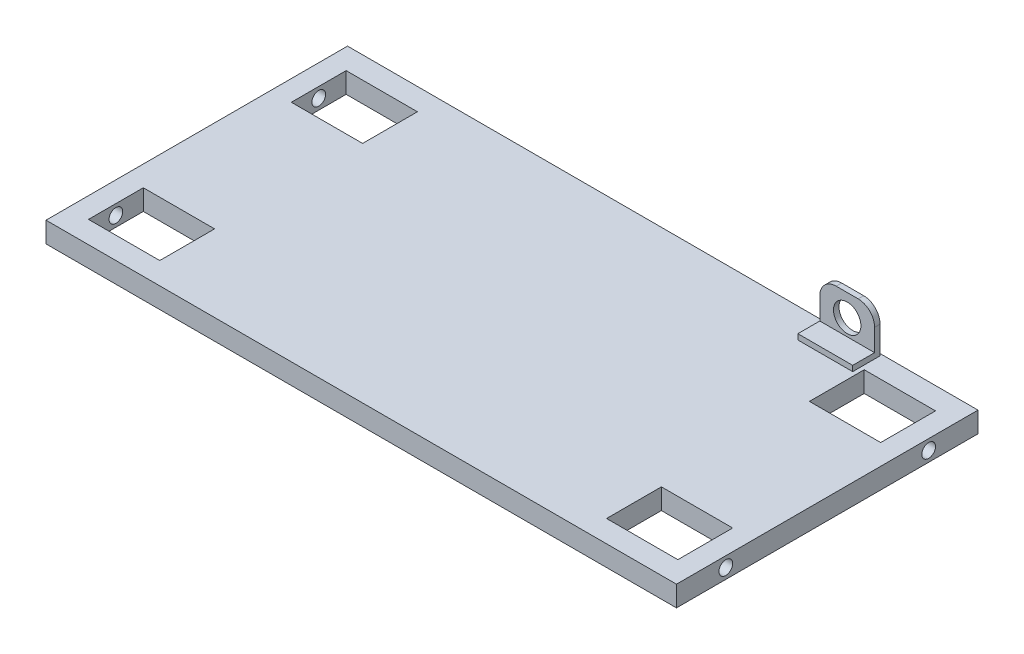
ISO-10303-21;
HEADER;
FILE_DESCRIPTION(('STEP AP214'),'2;1');
FILE_NAME('part.step','',(''),(''),'','','');
FILE_SCHEMA(('AUTOMOTIVE_DESIGN { 1 0 10303 214 1 1 1 1 }'));
ENDSEC;
DATA;
#1=APPLICATION_CONTEXT('core data for automotive mechanical design processes');
#2=APPLICATION_PROTOCOL_DEFINITION('international standard','automotive_design',2000,#1);
#3=PRODUCT_CONTEXT('',#1,'mechanical');
#4=PRODUCT('Part','Part','',(#3));
#5=PRODUCT_RELATED_PRODUCT_CATEGORY('part','',(#4));
#6=PRODUCT_DEFINITION_FORMATION('','',#4);
#7=PRODUCT_DEFINITION_CONTEXT('part definition',#1,'design');
#8=PRODUCT_DEFINITION('design','',#6,#7);
#9=PRODUCT_DEFINITION_SHAPE('','',#8);
#10=(LENGTH_UNIT() NAMED_UNIT(*) SI_UNIT(.MILLI.,.METRE.));
#11=(NAMED_UNIT(*) PLANE_ANGLE_UNIT() SI_UNIT($,.RADIAN.));
#12=(NAMED_UNIT(*) SI_UNIT($,.STERADIAN.) SOLID_ANGLE_UNIT());
#13=UNCERTAINTY_MEASURE_WITH_UNIT(LENGTH_MEASURE(1.E-05),#10,'distance_accuracy_value','');
#14=(GEOMETRIC_REPRESENTATION_CONTEXT(3) GLOBAL_UNCERTAINTY_ASSIGNED_CONTEXT((#13)) GLOBAL_UNIT_ASSIGNED_CONTEXT((#10,
#11,#12)) REPRESENTATION_CONTEXT('',''));
#15=CARTESIAN_POINT('',(0.,0.,0.));
#16=DIRECTION('',(0.,0.,1.));
#17=DIRECTION('',(1.,0.,0.));
#18=AXIS2_PLACEMENT_3D('',#15,#16,#17);
#19=CARTESIAN_POINT('',(76.1999999999999,29.845,-56.2407372591082));
#20=DIRECTION('',(0.,0.,-1.));
#21=DIRECTION('',(-1.,0.,0.));
#22=AXIS2_PLACEMENT_3D('',#19,#20,#21);
#23=PLANE('',#22);
#24=DIRECTION('',(1.,0.,0.));
#25=VECTOR('',#24,1.);
#26=CARTESIAN_POINT('',(76.1999999999999,12.065,-56.2407372591082));
#27=LINE('',#26,#25);
#28=CARTESIAN_POINT('',(76.1999999999999,12.065,-56.2407372591082));
#29=VERTEX_POINT('',#28);
#30=CARTESIAN_POINT('',(101.6,12.065,-56.2407372591082));
#31=VERTEX_POINT('',#30);
#32=EDGE_CURVE('E224',#29,#31,#27,.T.);
#33=ORIENTED_EDGE('',*,*,#32,.F.);
#34=DIRECTION('',(0.,-1.,0.));
#35=VECTOR('',#34,1.);
#36=CARTESIAN_POINT('',(76.1999999999999,29.845,-56.2407372591082));
#37=LINE('',#36,#35);
#38=CARTESIAN_POINT('',(76.1999999999999,9.525,-56.2407372591082));
#39=VERTEX_POINT('',#38);
#40=EDGE_CURVE('E234',#29,#39,#37,.T.);
#41=ORIENTED_EDGE('',*,*,#40,.T.);
#42=DIRECTION('',(1.,0.,0.));
#43=VECTOR('',#42,1.);
#44=CARTESIAN_POINT('',(76.1999999999999,9.525,-56.2407372591082));
#45=LINE('',#44,#43);
#46=CARTESIAN_POINT('',(101.6,9.525,-56.2407372591082));
#47=VERTEX_POINT('',#46);
#48=EDGE_CURVE('E450',#39,#47,#45,.T.);
#49=ORIENTED_EDGE('',*,*,#48,.T.);
#50=DIRECTION('',(0.,-1.,0.));
#51=VECTOR('',#50,1.);
#52=CARTESIAN_POINT('',(101.6,29.845,-56.2407372591082));
#53=LINE('',#52,#51);
#54=EDGE_CURVE('E236',#31,#47,#53,.T.);
#55=ORIENTED_EDGE('',*,*,#54,.F.);
#56=EDGE_LOOP('',(#33,#41,#49,#55));
#57=FACE_BOUND('',#56,.T.);
#58=ADVANCED_FACE('F36',(#57),#23,.F.);
#59=CARTESIAN_POINT('',(0.,9.525,0.));
#60=DIRECTION('',(0.,1.,0.));
#61=DIRECTION('',(0.,0.,1.));
#62=AXIS2_PLACEMENT_3D('',#59,#60,#61);
#63=PLANE('',#62);
#64=DIRECTION('',(0.,0.,-1.));
#65=VECTOR('',#64,1.);
#66=CARTESIAN_POINT('',(-103.505,9.525,59.69));
#67=LINE('',#66,#65);
#68=CARTESIAN_POINT('',(-103.505,9.525,59.69));
#69=VERTEX_POINT('',#68);
#70=CARTESIAN_POINT('',(-103.505,9.525,34.29));
#71=VERTEX_POINT('',#70);
#72=EDGE_CURVE('E282',#69,#71,#67,.T.);
#73=ORIENTED_EDGE('',*,*,#72,.F.);
#74=DIRECTION('',(1.,0.,0.));
#75=VECTOR('',#74,1.);
#76=CARTESIAN_POINT('',(-103.505,9.525,59.69));
#77=LINE('',#76,#75);
#78=CARTESIAN_POINT('',(-136.525,9.525,59.69));
#79=VERTEX_POINT('',#78);
#80=EDGE_CURVE('E291',#79,#69,#77,.T.);
#81=ORIENTED_EDGE('',*,*,#80,.F.);
#82=DIRECTION('',(0.,0.,1.));
#83=VECTOR('',#82,1.);
#84=CARTESIAN_POINT('',(-136.525,9.525,59.69));
#85=LINE('',#84,#83);
#86=CARTESIAN_POINT('',(-136.525,9.525,34.29));
#87=VERTEX_POINT('',#86);
#88=EDGE_CURVE('E288',#87,#79,#85,.T.);
#89=ORIENTED_EDGE('',*,*,#88,.F.);
#90=DIRECTION('',(-1.,0.,0.));
#91=VECTOR('',#90,1.);
#92=CARTESIAN_POINT('',(-136.525,9.525,34.29));
#93=LINE('',#92,#91);
#94=EDGE_CURVE('E284',#71,#87,#93,.T.);
#95=ORIENTED_EDGE('',*,*,#94,.F.);
#96=EDGE_LOOP('',(#73,#81,#89,#95));
#97=FACE_BOUND('',#96,.T.);
#98=DIRECTION('',(1.,0.,0.));
#99=VECTOR('',#98,1.);
#100=CARTESIAN_POINT('',(136.525,9.525,-34.29));
#101=LINE('',#100,#99);
#102=CARTESIAN_POINT('',(103.505,9.525,-34.29));
#103=VERTEX_POINT('',#102);
#104=CARTESIAN_POINT('',(136.525,9.525,-34.29));
#105=VERTEX_POINT('',#104);
#106=EDGE_CURVE('E312',#103,#105,#101,.T.);
#107=ORIENTED_EDGE('',*,*,#106,.F.);
#108=DIRECTION('',(0.,0.,1.));
#109=VECTOR('',#108,1.);
#110=CARTESIAN_POINT('',(103.505,9.525,-34.29));
#111=LINE('',#110,#109);
#112=CARTESIAN_POINT('',(103.505,9.525,-59.69));
#113=VERTEX_POINT('',#112);
#114=EDGE_CURVE('E321',#113,#103,#111,.T.);
#115=ORIENTED_EDGE('',*,*,#114,.F.);
#116=DIRECTION('',(-1.,0.,0.));
#117=VECTOR('',#116,1.);
#118=CARTESIAN_POINT('',(103.505,9.525,-59.69));
#119=LINE('',#118,#117);
#120=CARTESIAN_POINT('',(136.525,9.525,-59.69));
#121=VERTEX_POINT('',#120);
#122=EDGE_CURVE('E318',#121,#113,#119,.T.);
#123=ORIENTED_EDGE('',*,*,#122,.F.);
#124=DIRECTION('',(0.,0.,-1.));
#125=VECTOR('',#124,1.);
#126=CARTESIAN_POINT('',(136.525,9.525,-34.29));
#127=LINE('',#126,#125);
#128=EDGE_CURVE('E314',#105,#121,#127,.T.);
#129=ORIENTED_EDGE('',*,*,#128,.F.);
#130=EDGE_LOOP('',(#107,#115,#123,#129));
#131=FACE_BOUND('',#130,.T.);
#132=DIRECTION('',(0.,0.,1.));
#133=VECTOR('',#132,1.);
#134=CARTESIAN_POINT('',(103.505,9.525,59.69));
#135=LINE('',#134,#133);
#136=CARTESIAN_POINT('',(103.505,9.525,34.29));
#137=VERTEX_POINT('',#136);
#138=CARTESIAN_POINT('',(103.505,9.525,59.69));
#139=VERTEX_POINT('',#138);
#140=EDGE_CURVE('E270',#137,#139,#135,.T.);
#141=ORIENTED_EDGE('',*,*,#140,.F.);
#142=DIRECTION('',(-1.,0.,0.));
#143=VECTOR('',#142,1.);
#144=CARTESIAN_POINT('',(136.525,9.525,34.29));
#145=LINE('',#144,#143);
#146=CARTESIAN_POINT('',(136.525,9.525,34.29));
#147=VERTEX_POINT('',#146);
#148=EDGE_CURVE('E348',#147,#137,#145,.T.);
#149=ORIENTED_EDGE('',*,*,#148,.F.);
#150=DIRECTION('',(0.,0.,-1.));
#151=VECTOR('',#150,1.);
#152=CARTESIAN_POINT('',(136.525,9.525,59.69));
#153=LINE('',#152,#151);
#154=CARTESIAN_POINT('',(136.525,9.525,59.69));
#155=VERTEX_POINT('',#154);
#156=EDGE_CURVE('E345',#155,#147,#153,.T.);
#157=ORIENTED_EDGE('',*,*,#156,.F.);
#158=DIRECTION('',(1.,0.,0.));
#159=VECTOR('',#158,1.);
#160=CARTESIAN_POINT('',(103.505,9.525,59.69));
#161=LINE('',#160,#159);
#162=EDGE_CURVE('E342',#139,#155,#161,.T.);
#163=ORIENTED_EDGE('',*,*,#162,.F.);
#164=EDGE_LOOP('',(#141,#149,#157,#163));
#165=FACE_BOUND('',#164,.T.);
#166=DIRECTION('',(0.,0.,1.));
#167=VECTOR('',#166,1.);
#168=CARTESIAN_POINT('',(-136.525,9.525,-34.29));
#169=LINE('',#168,#167);
#170=CARTESIAN_POINT('',(-136.525,9.525,-59.69));
#171=VERTEX_POINT('',#170);
#172=CARTESIAN_POINT('',(-136.525,9.525,-34.29));
#173=VERTEX_POINT('',#172);
#174=EDGE_CURVE('E303',#171,#173,#169,.T.);
#175=ORIENTED_EDGE('',*,*,#174,.F.);
#176=DIRECTION('',(-1.,0.,0.));
#177=VECTOR('',#176,1.);
#178=CARTESIAN_POINT('',(-103.505,9.525,-59.69));
#179=LINE('',#178,#177);
#180=CARTESIAN_POINT('',(-103.505,9.525,-59.69));
#181=VERTEX_POINT('',#180);
#182=EDGE_CURVE('E376',#181,#171,#179,.T.);
#183=ORIENTED_EDGE('',*,*,#182,.F.);
#184=DIRECTION('',(0.,0.,-1.));
#185=VECTOR('',#184,1.);
#186=CARTESIAN_POINT('',(-103.505,9.525,-34.29));
#187=LINE('',#186,#185);
#188=CARTESIAN_POINT('',(-103.505,9.525,-34.29));
#189=VERTEX_POINT('',#188);
#190=EDGE_CURVE('E373',#189,#181,#187,.T.);
#191=ORIENTED_EDGE('',*,*,#190,.F.);
#192=DIRECTION('',(1.,0.,0.));
#193=VECTOR('',#192,1.);
#194=CARTESIAN_POINT('',(-136.525,9.525,-34.29));
#195=LINE('',#194,#193);
#196=EDGE_CURVE('E370',#173,#189,#195,.T.);
#197=ORIENTED_EDGE('',*,*,#196,.F.);
#198=EDGE_LOOP('',(#175,#183,#191,#197));
#199=FACE_BOUND('',#198,.T.);
#200=DIRECTION('',(0.,0.,1.));
#201=VECTOR('',#200,1.);
#202=CARTESIAN_POINT('',(-146.05,9.525,69.85));
#203=LINE('',#202,#201);
#204=CARTESIAN_POINT('',(-146.05,9.525,-69.85));
#205=VERTEX_POINT('',#204);
#206=CARTESIAN_POINT('',(-146.05,9.525,69.85));
#207=VERTEX_POINT('',#206);
#208=EDGE_CURVE('E389',#205,#207,#203,.T.);
#209=ORIENTED_EDGE('',*,*,#208,.T.);
#210=DIRECTION('',(1.,0.,0.));
#211=VECTOR('',#210,1.);
#212=CARTESIAN_POINT('',(146.05,9.525,69.85));
#213=LINE('',#212,#211);
#214=CARTESIAN_POINT('',(146.05,9.525,69.85));
#215=VERTEX_POINT('',#214);
#216=EDGE_CURVE('E392',#207,#215,#213,.T.);
#217=ORIENTED_EDGE('',*,*,#216,.T.);
#218=DIRECTION('',(0.,0.,-1.));
#219=VECTOR('',#218,1.);
#220=CARTESIAN_POINT('',(146.05,9.525,69.85));
#221=LINE('',#220,#219);
#222=CARTESIAN_POINT('',(146.05,9.525,-69.85));
#223=VERTEX_POINT('',#222);
#224=EDGE_CURVE('E395',#215,#223,#221,.T.);
#225=ORIENTED_EDGE('',*,*,#224,.T.);
#226=DIRECTION('',(-1.,0.,0.));
#227=VECTOR('',#226,1.);
#228=CARTESIAN_POINT('',(146.05,9.525,-69.85));
#229=LINE('',#228,#227);
#230=EDGE_CURVE('E397',#223,#205,#229,.T.);
#231=ORIENTED_EDGE('',*,*,#230,.T.);
#232=EDGE_LOOP('',(#209,#217,#225,#231));
#233=FACE_BOUND('',#232,.T.);
#234=ORIENTED_EDGE('',*,*,#48,.F.);
#235=DIRECTION('',(0.,0.,1.));
#236=VECTOR('',#235,1.);
#237=CARTESIAN_POINT('',(76.1999999999999,9.525,-68.9407372591082));
#238=LINE('',#237,#236);
#239=CARTESIAN_POINT('',(76.1999999999999,9.525,-68.9407372591082));
#240=VERTEX_POINT('',#239);
#241=EDGE_CURVE('E241',#240,#39,#238,.T.);
#242=ORIENTED_EDGE('',*,*,#241,.F.);
#243=DIRECTION('',(-1.,0.,0.));
#244=VECTOR('',#243,1.);
#245=CARTESIAN_POINT('',(76.1999999999999,9.525,-68.9407372591082));
#246=LINE('',#245,#244);
#247=CARTESIAN_POINT('',(101.6,9.525,-68.9407372591082));
#248=VERTEX_POINT('',#247);
#249=EDGE_CURVE('E442',#248,#240,#246,.T.);
#250=ORIENTED_EDGE('',*,*,#249,.F.);
#251=DIRECTION('',(0.,0.,-1.));
#252=VECTOR('',#251,1.);
#253=CARTESIAN_POINT('',(101.6,9.525,-68.9407372591082));
#254=LINE('',#253,#252);
#255=EDGE_CURVE('E458',#47,#248,#254,.T.);
#256=ORIENTED_EDGE('',*,*,#255,.F.);
#257=EDGE_LOOP('',(#234,#242,#250,#256));
#258=FACE_BOUND('',#257,.T.);
#259=ADVANCED_FACE('F468',(#97,#131,#165,#199,#233,#258),#63,.T.);
#260=CARTESIAN_POINT('',(-146.05,9.525,69.85));
#261=DIRECTION('',(1.,0.,0.));
#262=DIRECTION('',(0.,0.,-1.));
#263=AXIS2_PLACEMENT_3D('',#260,#261,#262);
#264=PLANE('',#263);
#265=CARTESIAN_POINT('',(-146.05,4.76249999999973,-46.99));
#266=DIRECTION('',(1.,0.,0.));
#267=DIRECTION('',(0.,0.,1.));
#268=AXIS2_PLACEMENT_3D('',#265,#266,#267);
#269=CIRCLE('',#268,3.175);
#270=CARTESIAN_POINT('',(-146.05,4.76249999999973,-43.815));
#271=VERTEX_POINT('',#270);
#272=EDGE_CURVE('E243',#271,#271,#269,.T.);
#273=ORIENTED_EDGE('',*,*,#272,.T.);
#274=EDGE_LOOP('',(#273));
#275=FACE_BOUND('',#274,.T.);
#276=CARTESIAN_POINT('',(-146.05,4.7625,46.99));
#277=DIRECTION('',(1.,0.,0.));
#278=DIRECTION('',(0.,0.,-1.));
#279=AXIS2_PLACEMENT_3D('',#276,#277,#278);
#280=CIRCLE('',#279,3.175);
#281=CARTESIAN_POINT('',(-146.05,4.7625,43.815));
#282=VERTEX_POINT('',#281);
#283=EDGE_CURVE('E253',#282,#282,#280,.T.);
#284=ORIENTED_EDGE('',*,*,#283,.T.);
#285=EDGE_LOOP('',(#284));
#286=FACE_BOUND('',#285,.T.);
#287=DIRECTION('',(0.,0.,1.));
#288=VECTOR('',#287,1.);
#289=CARTESIAN_POINT('',(-146.05,0.,69.85));
#290=LINE('',#289,#288);
#291=CARTESIAN_POINT('',(-146.05,0.,-69.85));
#292=VERTEX_POINT('',#291);
#293=CARTESIAN_POINT('',(-146.05,0.,69.85));
#294=VERTEX_POINT('',#293);
#295=EDGE_CURVE('E388',#292,#294,#290,.T.);
#296=ORIENTED_EDGE('',*,*,#295,.T.);
#297=DIRECTION('',(0.,-1.,0.));
#298=VECTOR('',#297,1.);
#299=CARTESIAN_POINT('',(-146.05,9.525,69.85));
#300=LINE('',#299,#298);
#301=EDGE_CURVE('E415',#207,#294,#300,.T.);
#302=ORIENTED_EDGE('',*,*,#301,.F.);
#303=ORIENTED_EDGE('',*,*,#208,.F.);
#304=DIRECTION('',(0.,-1.,0.));
#305=VECTOR('',#304,1.);
#306=CARTESIAN_POINT('',(-146.05,9.525,-69.85));
#307=LINE('',#306,#305);
#308=EDGE_CURVE('E399',#205,#292,#307,.T.);
#309=ORIENTED_EDGE('',*,*,#308,.T.);
#310=EDGE_LOOP('',(#296,#302,#303,#309));
#311=FACE_BOUND('',#310,.T.);
#312=ADVANCED_FACE('F470',(#275,#286,#311),#264,.F.);
#313=CARTESIAN_POINT('',(146.05,9.525,69.85));
#314=DIRECTION('',(0.,0.,-1.));
#315=DIRECTION('',(-1.,0.,0.));
#316=AXIS2_PLACEMENT_3D('',#313,#314,#315);
#317=PLANE('',#316);
#318=DIRECTION('',(1.,0.,0.));
#319=VECTOR('',#318,1.);
#320=CARTESIAN_POINT('',(146.05,0.,69.85));
#321=LINE('',#320,#319);
#322=CARTESIAN_POINT('',(146.05,0.,69.85));
#323=VERTEX_POINT('',#322);
#324=EDGE_CURVE('E402',#294,#323,#321,.T.);
#325=ORIENTED_EDGE('',*,*,#324,.T.);
#326=DIRECTION('',(0.,-1.,0.));
#327=VECTOR('',#326,1.);
#328=CARTESIAN_POINT('',(146.05,9.525,69.85));
#329=LINE('',#328,#327);
#330=EDGE_CURVE('E412',#215,#323,#329,.T.);
#331=ORIENTED_EDGE('',*,*,#330,.F.);
#332=ORIENTED_EDGE('',*,*,#216,.F.);
#333=ORIENTED_EDGE('',*,*,#301,.T.);
#334=EDGE_LOOP('',(#325,#331,#332,#333));
#335=FACE_BOUND('',#334,.T.);
#336=ADVANCED_FACE('F477',(#335),#317,.F.);
#337=CARTESIAN_POINT('',(146.05,9.525,69.85));
#338=DIRECTION('',(-1.,0.,0.));
#339=DIRECTION('',(0.,0.,1.));
#340=AXIS2_PLACEMENT_3D('',#337,#338,#339);
#341=PLANE('',#340);
#342=CARTESIAN_POINT('',(146.05,4.76249999999973,-46.99));
#343=DIRECTION('',(1.,0.,0.));
#344=DIRECTION('',(0.,0.,1.));
#345=AXIS2_PLACEMENT_3D('',#342,#343,#344);
#346=CIRCLE('',#345,3.175);
#347=CARTESIAN_POINT('',(146.05,4.76249999999973,-43.815));
#348=VERTEX_POINT('',#347);
#349=EDGE_CURVE('E258',#348,#348,#346,.T.);
#350=ORIENTED_EDGE('',*,*,#349,.F.);
#351=EDGE_LOOP('',(#350));
#352=FACE_BOUND('',#351,.T.);
#353=CARTESIAN_POINT('',(146.05,4.7625,46.99));
#354=DIRECTION('',(1.,0.,0.));
#355=DIRECTION('',(0.,0.,-1.));
#356=AXIS2_PLACEMENT_3D('',#353,#354,#355);
#357=CIRCLE('',#356,3.175);
#358=CARTESIAN_POINT('',(146.05,4.7625,43.815));
#359=VERTEX_POINT('',#358);
#360=EDGE_CURVE('E264',#359,#359,#357,.T.);
#361=ORIENTED_EDGE('',*,*,#360,.F.);
#362=EDGE_LOOP('',(#361));
#363=FACE_BOUND('',#362,.T.);
#364=DIRECTION('',(0.,0.,-1.));
#365=VECTOR('',#364,1.);
#366=CARTESIAN_POINT('',(146.05,0.,69.85));
#367=LINE('',#366,#365);
#368=CARTESIAN_POINT('',(146.05,0.,-69.85));
#369=VERTEX_POINT('',#368);
#370=EDGE_CURVE('E404',#323,#369,#367,.T.);
#371=ORIENTED_EDGE('',*,*,#370,.T.);
#372=DIRECTION('',(0.,-1.,0.));
#373=VECTOR('',#372,1.);
#374=CARTESIAN_POINT('',(146.05,9.525,-69.85));
#375=LINE('',#374,#373);
#376=EDGE_CURVE('E409',#223,#369,#375,.T.);
#377=ORIENTED_EDGE('',*,*,#376,.F.);
#378=ORIENTED_EDGE('',*,*,#224,.F.);
#379=ORIENTED_EDGE('',*,*,#330,.T.);
#380=EDGE_LOOP('',(#371,#377,#378,#379));
#381=FACE_BOUND('',#380,.T.);
#382=ADVANCED_FACE('F495',(#352,#363,#381),#341,.F.);
#383=CARTESIAN_POINT('',(146.05,9.525,-69.85));
#384=DIRECTION('',(0.,0.,1.));
#385=DIRECTION('',(1.,0.,0.));
#386=AXIS2_PLACEMENT_3D('',#383,#384,#385);
#387=PLANE('',#386);
#388=DIRECTION('',(-1.,0.,0.));
#389=VECTOR('',#388,1.);
#390=CARTESIAN_POINT('',(146.05,0.,-69.85));
#391=LINE('',#390,#389);
#392=EDGE_CURVE('E393',#369,#292,#391,.T.);
#393=ORIENTED_EDGE('',*,*,#392,.T.);
#394=ORIENTED_EDGE('',*,*,#308,.F.);
#395=ORIENTED_EDGE('',*,*,#230,.F.);
#396=ORIENTED_EDGE('',*,*,#376,.T.);
#397=EDGE_LOOP('',(#393,#394,#395,#396));
#398=FACE_BOUND('',#397,.T.);
#399=ADVANCED_FACE('F491',(#398),#387,.F.);
#400=CARTESIAN_POINT('',(0.,0.,0.));
#401=DIRECTION('',(0.,1.,0.));
#402=DIRECTION('',(0.,0.,1.));
#403=AXIS2_PLACEMENT_3D('',#400,#401,#402);
#404=PLANE('',#403);
#405=DIRECTION('',(-1.,0.,0.));
#406=VECTOR('',#405,1.);
#407=CARTESIAN_POINT('',(-103.505,0.,59.69));
#408=LINE('',#407,#406);
#409=CARTESIAN_POINT('',(-103.505,0.,59.69));
#410=VERTEX_POINT('',#409);
#411=CARTESIAN_POINT('',(-136.525,0.,59.69));
#412=VERTEX_POINT('',#411);
#413=EDGE_CURVE('E276',#410,#412,#408,.T.);
#414=ORIENTED_EDGE('',*,*,#413,.F.);
#415=DIRECTION('',(0.,0.,1.));
#416=VECTOR('',#415,1.);
#417=CARTESIAN_POINT('',(-103.505,0.,59.69));
#418=LINE('',#417,#416);
#419=CARTESIAN_POINT('',(-103.505,0.,34.29));
#420=VERTEX_POINT('',#419);
#421=EDGE_CURVE('E279',#420,#410,#418,.T.);
#422=ORIENTED_EDGE('',*,*,#421,.F.);
#423=DIRECTION('',(1.,0.,0.));
#424=VECTOR('',#423,1.);
#425=CARTESIAN_POINT('',(-136.525,0.,34.29));
#426=LINE('',#425,#424);
#427=CARTESIAN_POINT('',(-136.525,0.,34.29));
#428=VERTEX_POINT('',#427);
#429=EDGE_CURVE('E281',#428,#420,#426,.T.);
#430=ORIENTED_EDGE('',*,*,#429,.F.);
#431=DIRECTION('',(0.,0.,-1.));
#432=VECTOR('',#431,1.);
#433=CARTESIAN_POINT('',(-136.525,0.,59.69));
#434=LINE('',#433,#432);
#435=EDGE_CURVE('E273',#412,#428,#434,.T.);
#436=ORIENTED_EDGE('',*,*,#435,.F.);
#437=EDGE_LOOP('',(#414,#422,#430,#436));
#438=FACE_BOUND('',#437,.T.);
#439=DIRECTION('',(0.,0.,-1.));
#440=VECTOR('',#439,1.);
#441=CARTESIAN_POINT('',(103.505,0.,-34.29));
#442=LINE('',#441,#440);
#443=CARTESIAN_POINT('',(103.505,0.,-34.29));
#444=VERTEX_POINT('',#443);
#445=CARTESIAN_POINT('',(103.505,0.,-59.69));
#446=VERTEX_POINT('',#445);
#447=EDGE_CURVE('E307',#444,#446,#442,.T.);
#448=ORIENTED_EDGE('',*,*,#447,.F.);
#449=DIRECTION('',(-1.,0.,0.));
#450=VECTOR('',#449,1.);
#451=CARTESIAN_POINT('',(136.525,0.,-34.29));
#452=LINE('',#451,#450);
#453=CARTESIAN_POINT('',(136.525,0.,-34.29));
#454=VERTEX_POINT('',#453);
#455=EDGE_CURVE('E310',#454,#444,#452,.T.);
#456=ORIENTED_EDGE('',*,*,#455,.F.);
#457=DIRECTION('',(0.,0.,1.));
#458=VECTOR('',#457,1.);
#459=CARTESIAN_POINT('',(136.525,0.,-34.29));
#460=LINE('',#459,#458);
#461=CARTESIAN_POINT('',(136.525,0.,-59.69));
#462=VERTEX_POINT('',#461);
#463=EDGE_CURVE('E285',#462,#454,#460,.T.);
#464=ORIENTED_EDGE('',*,*,#463,.F.);
#465=DIRECTION('',(1.,0.,0.));
#466=VECTOR('',#465,1.);
#467=CARTESIAN_POINT('',(103.505,0.,-59.69));
#468=LINE('',#467,#466);
#469=EDGE_CURVE('E304',#446,#462,#468,.T.);
#470=ORIENTED_EDGE('',*,*,#469,.F.);
#471=EDGE_LOOP('',(#448,#456,#464,#470));
#472=FACE_BOUND('',#471,.T.);
#473=DIRECTION('',(1.,0.,0.));
#474=VECTOR('',#473,1.);
#475=CARTESIAN_POINT('',(136.525,0.,34.29));
#476=LINE('',#475,#474);
#477=CARTESIAN_POINT('',(103.505,0.,34.29));
#478=VERTEX_POINT('',#477);
#479=CARTESIAN_POINT('',(136.525,0.,34.29));
#480=VERTEX_POINT('',#479);
#481=EDGE_CURVE('E336',#478,#480,#476,.T.);
#482=ORIENTED_EDGE('',*,*,#481,.F.);
#483=DIRECTION('',(0.,0.,-1.));
#484=VECTOR('',#483,1.);
#485=CARTESIAN_POINT('',(103.505,0.,59.69));
#486=LINE('',#485,#484);
#487=CARTESIAN_POINT('',(103.505,0.,59.69));
#488=VERTEX_POINT('',#487);
#489=EDGE_CURVE('E339',#488,#478,#486,.T.);
#490=ORIENTED_EDGE('',*,*,#489,.F.);
#491=DIRECTION('',(-1.,0.,0.));
#492=VECTOR('',#491,1.);
#493=CARTESIAN_POINT('',(103.505,0.,59.69));
#494=LINE('',#493,#492);
#495=CARTESIAN_POINT('',(136.525,0.,59.69));
#496=VERTEX_POINT('',#495);
#497=EDGE_CURVE('E315',#496,#488,#494,.T.);
#498=ORIENTED_EDGE('',*,*,#497,.F.);
#499=DIRECTION('',(0.,0.,1.));
#500=VECTOR('',#499,1.);
#501=CARTESIAN_POINT('',(136.525,0.,59.69));
#502=LINE('',#501,#500);
#503=EDGE_CURVE('E333',#480,#496,#502,.T.);
#504=ORIENTED_EDGE('',*,*,#503,.F.);
#505=EDGE_LOOP('',(#482,#490,#498,#504));
#506=FACE_BOUND('',#505,.T.);
#507=DIRECTION('',(1.,0.,0.));
#508=VECTOR('',#507,1.);
#509=CARTESIAN_POINT('',(-103.505,0.,-59.69));
#510=LINE('',#509,#508);
#511=CARTESIAN_POINT('',(-136.525,0.,-59.69));
#512=VERTEX_POINT('',#511);
#513=CARTESIAN_POINT('',(-103.505,0.,-59.69));
#514=VERTEX_POINT('',#513);
#515=EDGE_CURVE('E363',#512,#514,#510,.T.);
#516=ORIENTED_EDGE('',*,*,#515,.F.);
#517=DIRECTION('',(0.,0.,-1.));
#518=VECTOR('',#517,1.);
#519=CARTESIAN_POINT('',(-136.525,0.,-34.29));
#520=LINE('',#519,#518);
#521=CARTESIAN_POINT('',(-136.525,0.,-34.29));
#522=VERTEX_POINT('',#521);
#523=EDGE_CURVE('E366',#522,#512,#520,.T.);
#524=ORIENTED_EDGE('',*,*,#523,.F.);
#525=DIRECTION('',(-1.,0.,0.));
#526=VECTOR('',#525,1.);
#527=CARTESIAN_POINT('',(-136.525,0.,-34.29));
#528=LINE('',#527,#526);
#529=CARTESIAN_POINT('',(-103.505,0.,-34.29));
#530=VERTEX_POINT('',#529);
#531=EDGE_CURVE('E368',#530,#522,#528,.T.);
#532=ORIENTED_EDGE('',*,*,#531,.F.);
#533=DIRECTION('',(0.,0.,1.));
#534=VECTOR('',#533,1.);
#535=CARTESIAN_POINT('',(-103.505,0.,-34.29));
#536=LINE('',#535,#534);
#537=EDGE_CURVE('E360',#514,#530,#536,.T.);
#538=ORIENTED_EDGE('',*,*,#537,.F.);
#539=EDGE_LOOP('',(#516,#524,#532,#538));
#540=FACE_BOUND('',#539,.T.);
#541=ORIENTED_EDGE('',*,*,#295,.F.);
#542=ORIENTED_EDGE('',*,*,#392,.F.);
#543=ORIENTED_EDGE('',*,*,#370,.F.);
#544=ORIENTED_EDGE('',*,*,#324,.F.);
#545=EDGE_LOOP('',(#541,#542,#543,#544));
#546=FACE_BOUND('',#545,.T.);
#547=ADVANCED_FACE('F488',(#438,#472,#506,#540,#546),#404,.F.);
#548=CARTESIAN_POINT('',(-136.525,-41.6590974458161,-34.29));
#549=DIRECTION('',(-1.,0.,0.));
#550=DIRECTION('',(0.,0.,1.));
#551=AXIS2_PLACEMENT_3D('',#548,#549,#550);
#552=PLANE('',#551);
#553=CARTESIAN_POINT('',(-136.525,4.76249999999973,-46.99));
#554=DIRECTION('',(1.,0.,0.));
#555=DIRECTION('',(0.,0.,1.));
#556=AXIS2_PLACEMENT_3D('',#553,#554,#555);
#557=CIRCLE('',#556,3.175);
#558=CARTESIAN_POINT('',(-136.525,4.76249999999973,-43.815));
#559=VERTEX_POINT('',#558);
#560=EDGE_CURVE('E246',#559,#559,#557,.T.);
#561=ORIENTED_EDGE('',*,*,#560,.F.);
#562=EDGE_LOOP('',(#561));
#563=FACE_BOUND('',#562,.T.);
#564=ORIENTED_EDGE('',*,*,#523,.T.);
#565=DIRECTION('',(0.,1.,0.));
#566=VECTOR('',#565,1.);
#567=CARTESIAN_POINT('',(-136.525,-41.6590974458161,-59.69));
#568=LINE('',#567,#566);
#569=EDGE_CURVE('E364',#512,#171,#568,.T.);
#570=ORIENTED_EDGE('',*,*,#569,.T.);
#571=ORIENTED_EDGE('',*,*,#174,.T.);
#572=DIRECTION('',(0.,1.,0.));
#573=VECTOR('',#572,1.);
#574=CARTESIAN_POINT('',(-136.525,-41.6590974458161,-34.29));
#575=LINE('',#574,#573);
#576=EDGE_CURVE('E379',#522,#173,#575,.T.);
#577=ORIENTED_EDGE('',*,*,#576,.F.);
#578=EDGE_LOOP('',(#564,#570,#571,#577));
#579=FACE_BOUND('',#578,.T.);
#580=ADVANCED_FACE('F486',(#563,#579),#552,.F.);
#581=CARTESIAN_POINT('',(-103.505,-41.6590974458161,-59.69));
#582=DIRECTION('',(0.,0.,-1.));
#583=DIRECTION('',(-1.,0.,0.));
#584=AXIS2_PLACEMENT_3D('',#581,#582,#583);
#585=PLANE('',#584);
#586=ORIENTED_EDGE('',*,*,#515,.T.);
#587=DIRECTION('',(0.,1.,0.));
#588=VECTOR('',#587,1.);
#589=CARTESIAN_POINT('',(-103.505,-41.6590974458161,-59.69));
#590=LINE('',#589,#588);
#591=EDGE_CURVE('E381',#514,#181,#590,.T.);
#592=ORIENTED_EDGE('',*,*,#591,.T.);
#593=ORIENTED_EDGE('',*,*,#182,.T.);
#594=ORIENTED_EDGE('',*,*,#569,.F.);
#595=EDGE_LOOP('',(#586,#592,#593,#594));
#596=FACE_BOUND('',#595,.T.);
#597=ADVANCED_FACE('F591',(#596),#585,.F.);
#598=CARTESIAN_POINT('',(-103.505,-41.6590974458161,-34.29));
#599=DIRECTION('',(1.,0.,0.));
#600=DIRECTION('',(0.,0.,-1.));
#601=AXIS2_PLACEMENT_3D('',#598,#599,#600);
#602=PLANE('',#601);
#603=ORIENTED_EDGE('',*,*,#537,.T.);
#604=DIRECTION('',(0.,1.,0.));
#605=VECTOR('',#604,1.);
#606=CARTESIAN_POINT('',(-103.505,-41.6590974458161,-34.29));
#607=LINE('',#606,#605);
#608=EDGE_CURVE('E383',#530,#189,#607,.T.);
#609=ORIENTED_EDGE('',*,*,#608,.T.);
#610=ORIENTED_EDGE('',*,*,#190,.T.);
#611=ORIENTED_EDGE('',*,*,#591,.F.);
#612=EDGE_LOOP('',(#603,#609,#610,#611));
#613=FACE_BOUND('',#612,.T.);
#614=ADVANCED_FACE('F594',(#613),#602,.F.);
#615=CARTESIAN_POINT('',(-136.525,-41.6590974458161,-34.29));
#616=DIRECTION('',(0.,0.,1.));
#617=DIRECTION('',(1.,0.,0.));
#618=AXIS2_PLACEMENT_3D('',#615,#616,#617);
#619=PLANE('',#618);
#620=ORIENTED_EDGE('',*,*,#531,.T.);
#621=ORIENTED_EDGE('',*,*,#576,.T.);
#622=ORIENTED_EDGE('',*,*,#196,.T.);
#623=ORIENTED_EDGE('',*,*,#608,.F.);
#624=EDGE_LOOP('',(#620,#621,#622,#623));
#625=FACE_BOUND('',#624,.T.);
#626=ADVANCED_FACE('F589',(#625),#619,.F.);
#627=CARTESIAN_POINT('',(103.505,-41.6590974458161,59.69));
#628=DIRECTION('',(-1.,0.,0.));
#629=DIRECTION('',(0.,0.,1.));
#630=AXIS2_PLACEMENT_3D('',#627,#628,#629);
#631=PLANE('',#630);
#632=ORIENTED_EDGE('',*,*,#489,.T.);
#633=DIRECTION('',(0.,1.,0.));
#634=VECTOR('',#633,1.);
#635=CARTESIAN_POINT('',(103.505,-41.6590974458161,34.29));
#636=LINE('',#635,#634);
#637=EDGE_CURVE('E337',#478,#137,#636,.T.);
#638=ORIENTED_EDGE('',*,*,#637,.T.);
#639=ORIENTED_EDGE('',*,*,#140,.T.);
#640=DIRECTION('',(0.,1.,0.));
#641=VECTOR('',#640,1.);
#642=CARTESIAN_POINT('',(103.505,-41.6590974458161,59.69));
#643=LINE('',#642,#641);
#644=EDGE_CURVE('E351',#488,#139,#643,.T.);
#645=ORIENTED_EDGE('',*,*,#644,.F.);
#646=EDGE_LOOP('',(#632,#638,#639,#645));
#647=FACE_BOUND('',#646,.T.);
#648=ADVANCED_FACE('F579',(#647),#631,.F.);
#649=CARTESIAN_POINT('',(136.525,-41.6590974458161,34.29));
#650=DIRECTION('',(0.,0.,-1.));
#651=DIRECTION('',(-1.,0.,0.));
#652=AXIS2_PLACEMENT_3D('',#649,#650,#651);
#653=PLANE('',#652);
#654=ORIENTED_EDGE('',*,*,#481,.T.);
#655=DIRECTION('',(0.,1.,0.));
#656=VECTOR('',#655,1.);
#657=CARTESIAN_POINT('',(136.525,-41.6590974458161,34.29));
#658=LINE('',#657,#656);
#659=EDGE_CURVE('E353',#480,#147,#658,.T.);
#660=ORIENTED_EDGE('',*,*,#659,.T.);
#661=ORIENTED_EDGE('',*,*,#148,.T.);
#662=ORIENTED_EDGE('',*,*,#637,.F.);
#663=EDGE_LOOP('',(#654,#660,#661,#662));
#664=FACE_BOUND('',#663,.T.);
#665=ADVANCED_FACE('F575',(#664),#653,.F.);
#666=CARTESIAN_POINT('',(136.525,-41.6590974458161,59.69));
#667=DIRECTION('',(1.,0.,0.));
#668=DIRECTION('',(0.,0.,-1.));
#669=AXIS2_PLACEMENT_3D('',#666,#667,#668);
#670=PLANE('',#669);
#671=CARTESIAN_POINT('',(136.525,4.7625,46.99));
#672=DIRECTION('',(1.,0.,0.));
#673=DIRECTION('',(0.,0.,-1.));
#674=AXIS2_PLACEMENT_3D('',#671,#672,#673);
#675=CIRCLE('',#674,3.175);
#676=CARTESIAN_POINT('',(136.525,4.7625,43.815));
#677=VERTEX_POINT('',#676);
#678=EDGE_CURVE('E267',#677,#677,#675,.T.);
#679=ORIENTED_EDGE('',*,*,#678,.T.);
#680=EDGE_LOOP('',(#679));
#681=FACE_BOUND('',#680,.T.);
#682=ORIENTED_EDGE('',*,*,#503,.T.);
#683=DIRECTION('',(0.,1.,0.));
#684=VECTOR('',#683,1.);
#685=CARTESIAN_POINT('',(136.525,-41.6590974458161,59.69));
#686=LINE('',#685,#684);
#687=EDGE_CURVE('E355',#496,#155,#686,.T.);
#688=ORIENTED_EDGE('',*,*,#687,.T.);
#689=ORIENTED_EDGE('',*,*,#156,.T.);
#690=ORIENTED_EDGE('',*,*,#659,.F.);
#691=EDGE_LOOP('',(#682,#688,#689,#690));
#692=FACE_BOUND('',#691,.T.);
#693=ADVANCED_FACE('F578',(#681,#692),#670,.F.);
#694=CARTESIAN_POINT('',(103.505,-41.6590974458161,59.69));
#695=DIRECTION('',(0.,0.,1.));
#696=DIRECTION('',(1.,0.,0.));
#697=AXIS2_PLACEMENT_3D('',#694,#695,#696);
#698=PLANE('',#697);
#699=ORIENTED_EDGE('',*,*,#497,.T.);
#700=ORIENTED_EDGE('',*,*,#644,.T.);
#701=ORIENTED_EDGE('',*,*,#162,.T.);
#702=ORIENTED_EDGE('',*,*,#687,.F.);
#703=EDGE_LOOP('',(#699,#700,#701,#702));
#704=FACE_BOUND('',#703,.T.);
#705=ADVANCED_FACE('F573',(#704),#698,.F.);
#706=CARTESIAN_POINT('',(136.525,-41.6590974458161,-34.29));
#707=DIRECTION('',(0.,0.,1.));
#708=DIRECTION('',(1.,0.,0.));
#709=AXIS2_PLACEMENT_3D('',#706,#707,#708);
#710=PLANE('',#709);
#711=ORIENTED_EDGE('',*,*,#455,.T.);
#712=DIRECTION('',(0.,1.,0.));
#713=VECTOR('',#712,1.);
#714=CARTESIAN_POINT('',(103.505,-41.6590974458161,-34.29));
#715=LINE('',#714,#713);
#716=EDGE_CURVE('E308',#444,#103,#715,.T.);
#717=ORIENTED_EDGE('',*,*,#716,.T.);
#718=ORIENTED_EDGE('',*,*,#106,.T.);
#719=DIRECTION('',(0.,1.,0.));
#720=VECTOR('',#719,1.);
#721=CARTESIAN_POINT('',(136.525,-41.6590974458161,-34.29));
#722=LINE('',#721,#720);
#723=EDGE_CURVE('E324',#454,#105,#722,.T.);
#724=ORIENTED_EDGE('',*,*,#723,.F.);
#725=EDGE_LOOP('',(#711,#717,#718,#724));
#726=FACE_BOUND('',#725,.T.);
#727=ADVANCED_FACE('F563',(#726),#710,.F.);
#728=CARTESIAN_POINT('',(103.505,-41.6590974458161,-34.29));
#729=DIRECTION('',(-1.,0.,0.));
#730=DIRECTION('',(0.,0.,1.));
#731=AXIS2_PLACEMENT_3D('',#728,#729,#730);
#732=PLANE('',#731);
#733=ORIENTED_EDGE('',*,*,#447,.T.);
#734=DIRECTION('',(0.,1.,0.));
#735=VECTOR('',#734,1.);
#736=CARTESIAN_POINT('',(103.505,-41.6590974458161,-59.69));
#737=LINE('',#736,#735);
#738=EDGE_CURVE('E326',#446,#113,#737,.T.);
#739=ORIENTED_EDGE('',*,*,#738,.T.);
#740=ORIENTED_EDGE('',*,*,#114,.T.);
#741=ORIENTED_EDGE('',*,*,#716,.F.);
#742=EDGE_LOOP('',(#733,#739,#740,#741));
#743=FACE_BOUND('',#742,.T.);
#744=ADVANCED_FACE('F559',(#743),#732,.F.);
#745=CARTESIAN_POINT('',(103.505,-41.6590974458161,-59.69));
#746=DIRECTION('',(0.,0.,-1.));
#747=DIRECTION('',(-1.,0.,0.));
#748=AXIS2_PLACEMENT_3D('',#745,#746,#747);
#749=PLANE('',#748);
#750=ORIENTED_EDGE('',*,*,#469,.T.);
#751=DIRECTION('',(0.,1.,0.));
#752=VECTOR('',#751,1.);
#753=CARTESIAN_POINT('',(136.525,-41.6590974458161,-59.69));
#754=LINE('',#753,#752);
#755=EDGE_CURVE('E328',#462,#121,#754,.T.);
#756=ORIENTED_EDGE('',*,*,#755,.T.);
#757=ORIENTED_EDGE('',*,*,#122,.T.);
#758=ORIENTED_EDGE('',*,*,#738,.F.);
#759=EDGE_LOOP('',(#750,#756,#757,#758));
#760=FACE_BOUND('',#759,.T.);
#761=ADVANCED_FACE('F562',(#760),#749,.F.);
#762=CARTESIAN_POINT('',(136.525,-41.6590974458161,-34.29));
#763=DIRECTION('',(1.,0.,0.));
#764=DIRECTION('',(0.,0.,-1.));
#765=AXIS2_PLACEMENT_3D('',#762,#763,#764);
#766=PLANE('',#765);
#767=CARTESIAN_POINT('',(136.525,4.76249999999973,-46.99));
#768=DIRECTION('',(1.,0.,0.));
#769=DIRECTION('',(0.,0.,1.));
#770=AXIS2_PLACEMENT_3D('',#767,#768,#769);
#771=CIRCLE('',#770,3.175);
#772=CARTESIAN_POINT('',(136.525,4.76249999999973,-43.815));
#773=VERTEX_POINT('',#772);
#774=EDGE_CURVE('E261',#773,#773,#771,.T.);
#775=ORIENTED_EDGE('',*,*,#774,.T.);
#776=EDGE_LOOP('',(#775));
#777=FACE_BOUND('',#776,.T.);
#778=ORIENTED_EDGE('',*,*,#463,.T.);
#779=ORIENTED_EDGE('',*,*,#723,.T.);
#780=ORIENTED_EDGE('',*,*,#128,.T.);
#781=ORIENTED_EDGE('',*,*,#755,.F.);
#782=EDGE_LOOP('',(#778,#779,#780,#781));
#783=FACE_BOUND('',#782,.T.);
#784=ADVANCED_FACE('F557',(#777,#783),#766,.F.);
#785=CARTESIAN_POINT('',(-103.505,-41.6590974458161,59.69));
#786=DIRECTION('',(1.,0.,0.));
#787=DIRECTION('',(0.,0.,-1.));
#788=AXIS2_PLACEMENT_3D('',#785,#786,#787);
#789=PLANE('',#788);
#790=ORIENTED_EDGE('',*,*,#421,.T.);
#791=DIRECTION('',(0.,1.,0.));
#792=VECTOR('',#791,1.);
#793=CARTESIAN_POINT('',(-103.505,-41.6590974458161,59.69));
#794=LINE('',#793,#792);
#795=EDGE_CURVE('E277',#410,#69,#794,.T.);
#796=ORIENTED_EDGE('',*,*,#795,.T.);
#797=ORIENTED_EDGE('',*,*,#72,.T.);
#798=DIRECTION('',(0.,1.,0.));
#799=VECTOR('',#798,1.);
#800=CARTESIAN_POINT('',(-103.505,-41.6590974458161,34.29));
#801=LINE('',#800,#799);
#802=EDGE_CURVE('E294',#420,#71,#801,.T.);
#803=ORIENTED_EDGE('',*,*,#802,.F.);
#804=EDGE_LOOP('',(#790,#796,#797,#803));
#805=FACE_BOUND('',#804,.T.);
#806=ADVANCED_FACE('F547',(#805),#789,.F.);
#807=CARTESIAN_POINT('',(-103.505,-41.6590974458161,59.69));
#808=DIRECTION('',(0.,0.,1.));
#809=DIRECTION('',(1.,0.,0.));
#810=AXIS2_PLACEMENT_3D('',#807,#808,#809);
#811=PLANE('',#810);
#812=ORIENTED_EDGE('',*,*,#413,.T.);
#813=DIRECTION('',(0.,1.,0.));
#814=VECTOR('',#813,1.);
#815=CARTESIAN_POINT('',(-136.525,-41.6590974458161,59.69));
#816=LINE('',#815,#814);
#817=EDGE_CURVE('E296',#412,#79,#816,.T.);
#818=ORIENTED_EDGE('',*,*,#817,.T.);
#819=ORIENTED_EDGE('',*,*,#80,.T.);
#820=ORIENTED_EDGE('',*,*,#795,.F.);
#821=EDGE_LOOP('',(#812,#818,#819,#820));
#822=FACE_BOUND('',#821,.T.);
#823=ADVANCED_FACE('F543',(#822),#811,.F.);
#824=CARTESIAN_POINT('',(-136.525,-41.6590974458161,59.69));
#825=DIRECTION('',(-1.,0.,0.));
#826=DIRECTION('',(0.,0.,1.));
#827=AXIS2_PLACEMENT_3D('',#824,#825,#826);
#828=PLANE('',#827);
#829=CARTESIAN_POINT('',(-136.525,4.7625,46.99));
#830=DIRECTION('',(1.,0.,0.));
#831=DIRECTION('',(0.,0.,-1.));
#832=AXIS2_PLACEMENT_3D('',#829,#830,#831);
#833=CIRCLE('',#832,3.175);
#834=CARTESIAN_POINT('',(-136.525,4.7625,43.815));
#835=VERTEX_POINT('',#834);
#836=EDGE_CURVE('E255',#835,#835,#833,.T.);
#837=ORIENTED_EDGE('',*,*,#836,.F.);
#838=EDGE_LOOP('',(#837));
#839=FACE_BOUND('',#838,.T.);
#840=ORIENTED_EDGE('',*,*,#435,.T.);
#841=DIRECTION('',(0.,1.,0.));
#842=VECTOR('',#841,1.);
#843=CARTESIAN_POINT('',(-136.525,-41.6590974458161,34.29));
#844=LINE('',#843,#842);
#845=EDGE_CURVE('E298',#428,#87,#844,.T.);
#846=ORIENTED_EDGE('',*,*,#845,.T.);
#847=ORIENTED_EDGE('',*,*,#88,.T.);
#848=ORIENTED_EDGE('',*,*,#817,.F.);
#849=EDGE_LOOP('',(#840,#846,#847,#848));
#850=FACE_BOUND('',#849,.T.);
#851=ADVANCED_FACE('F546',(#839,#850),#828,.F.);
#852=CARTESIAN_POINT('',(-136.525,-41.6590974458161,34.29));
#853=DIRECTION('',(0.,0.,-1.));
#854=DIRECTION('',(-1.,0.,0.));
#855=AXIS2_PLACEMENT_3D('',#852,#853,#854);
#856=PLANE('',#855);
#857=ORIENTED_EDGE('',*,*,#429,.T.);
#858=ORIENTED_EDGE('',*,*,#802,.T.);
#859=ORIENTED_EDGE('',*,*,#94,.T.);
#860=ORIENTED_EDGE('',*,*,#845,.F.);
#861=EDGE_LOOP('',(#857,#858,#859,#860));
#862=FACE_BOUND('',#861,.T.);
#863=ADVANCED_FACE('F541',(#862),#856,.F.);
#864=CARTESIAN_POINT('',(136.525,4.7625,46.99));
#865=DIRECTION('',(1.,0.,0.));
#866=DIRECTION('',(0.,0.,-1.));
#867=AXIS2_PLACEMENT_3D('',#864,#865,#866);
#868=CYLINDRICAL_SURFACE('',#867,3.175);
#869=ORIENTED_EDGE('',*,*,#678,.F.);
#870=EDGE_LOOP('',(#869));
#871=FACE_BOUND('',#870,.T.);
#872=ORIENTED_EDGE('',*,*,#360,.T.);
#873=EDGE_LOOP('',(#872));
#874=FACE_BOUND('',#873,.T.);
#875=ADVANCED_FACE('F537',(#871,#874),#868,.F.);
#876=CARTESIAN_POINT('',(136.525,4.76249999999973,-46.99));
#877=DIRECTION('',(1.,0.,0.));
#878=DIRECTION('',(0.,0.,-1.));
#879=AXIS2_PLACEMENT_3D('',#876,#877,#878);
#880=CYLINDRICAL_SURFACE('',#879,3.175);
#881=ORIENTED_EDGE('',*,*,#774,.F.);
#882=EDGE_LOOP('',(#881));
#883=FACE_BOUND('',#882,.T.);
#884=ORIENTED_EDGE('',*,*,#349,.T.);
#885=EDGE_LOOP('',(#884));
#886=FACE_BOUND('',#885,.T.);
#887=ADVANCED_FACE('F533',(#883,#886),#880,.F.);
#888=CARTESIAN_POINT('',(-136.525,4.7625,46.99));
#889=DIRECTION('',(-1.,0.,0.));
#890=DIRECTION('',(0.,0.,1.));
#891=AXIS2_PLACEMENT_3D('',#888,#889,#890);
#892=CYLINDRICAL_SURFACE('',#891,3.175);
#893=ORIENTED_EDGE('',*,*,#836,.T.);
#894=EDGE_LOOP('',(#893));
#895=FACE_BOUND('',#894,.T.);
#896=ORIENTED_EDGE('',*,*,#283,.F.);
#897=EDGE_LOOP('',(#896));
#898=FACE_BOUND('',#897,.T.);
#899=ADVANCED_FACE('F529',(#895,#898),#892,.F.);
#900=CARTESIAN_POINT('',(-136.525,4.76249999999973,-46.99));
#901=DIRECTION('',(-1.,0.,0.));
#902=DIRECTION('',(0.,0.,1.));
#903=AXIS2_PLACEMENT_3D('',#900,#901,#902);
#904=CYLINDRICAL_SURFACE('',#903,3.175);
#905=ORIENTED_EDGE('',*,*,#560,.T.);
#906=EDGE_LOOP('',(#905));
#907=FACE_BOUND('',#906,.T.);
#908=ORIENTED_EDGE('',*,*,#272,.F.);
#909=EDGE_LOOP('',(#908));
#910=FACE_BOUND('',#909,.T.);
#911=ADVANCED_FACE('F526',(#907,#910),#904,.F.);
#912=CARTESIAN_POINT('',(76.1999999999999,29.845,-68.9407372591082));
#913=DIRECTION('',(1.,0.,0.));
#914=DIRECTION('',(0.,0.,-1.));
#915=AXIS2_PLACEMENT_3D('',#912,#913,#914);
#916=PLANE('',#915);
#917=DIRECTION('',(0.,1.,0.));
#918=VECTOR('',#917,1.);
#919=CARTESIAN_POINT('',(76.1999999999999,12.065,-66.4007372591082));
#920=LINE('',#919,#918);
#921=CARTESIAN_POINT('',(76.1999999999999,12.065,-66.4007372591082));
#922=VERTEX_POINT('',#921);
#923=CARTESIAN_POINT('',(76.1999999999999,22.225,-66.4007372591082));
#924=VERTEX_POINT('',#923);
#925=EDGE_CURVE('E447',#922,#924,#920,.T.);
#926=ORIENTED_EDGE('',*,*,#925,.T.);
#927=DIRECTION('',(0.,0.,1.));
#928=VECTOR('',#927,1.);
#929=CARTESIAN_POINT('',(76.1999999999999,22.225,-68.9407372591082));
#930=LINE('',#929,#928);
#931=CARTESIAN_POINT('',(76.1999999999999,22.225,-68.9407372591082));
#932=VERTEX_POINT('',#931);
#933=EDGE_CURVE('E59',#924,#932,#930,.F.);
#934=ORIENTED_EDGE('',*,*,#933,.T.);
#935=DIRECTION('',(0.,-1.,0.));
#936=VECTOR('',#935,1.);
#937=CARTESIAN_POINT('',(76.1999999999999,29.845,-68.9407372591082));
#938=LINE('',#937,#936);
#939=EDGE_CURVE('E434',#932,#240,#938,.T.);
#940=ORIENTED_EDGE('',*,*,#939,.T.);
#941=ORIENTED_EDGE('',*,*,#241,.T.);
#942=ORIENTED_EDGE('',*,*,#40,.F.);
#943=DIRECTION('',(0.,0.,1.));
#944=VECTOR('',#943,1.);
#945=CARTESIAN_POINT('',(76.1999999999999,12.065,-66.4007372591082));
#946=LINE('',#945,#944);
#947=EDGE_CURVE('E221',#922,#29,#946,.T.);
#948=ORIENTED_EDGE('',*,*,#947,.F.);
#949=EDGE_LOOP('',(#926,#934,#940,#941,#942,#948));
#950=FACE_BOUND('',#949,.T.);
#951=ADVANCED_FACE('F239',(#950),#916,.F.);
#952=CARTESIAN_POINT('',(101.6,29.845,-68.9407372591082));
#953=DIRECTION('',(-1.,0.,0.));
#954=DIRECTION('',(0.,0.,1.));
#955=AXIS2_PLACEMENT_3D('',#952,#953,#954);
#956=PLANE('',#955);
#957=DIRECTION('',(0.,-1.,0.));
#958=VECTOR('',#957,1.);
#959=CARTESIAN_POINT('',(101.6,29.845,-68.9407372591082));
#960=LINE('',#959,#958);
#961=CARTESIAN_POINT('',(101.6,22.225,-68.9407372591082));
#962=VERTEX_POINT('',#961);
#963=EDGE_CURVE('E248',#962,#248,#960,.T.);
#964=ORIENTED_EDGE('',*,*,#963,.F.);
#965=DIRECTION('',(0.,0.,-1.));
#966=VECTOR('',#965,1.);
#967=CARTESIAN_POINT('',(101.6,22.225,-66.4007372591082));
#968=LINE('',#967,#966);
#969=CARTESIAN_POINT('',(101.6,22.225,-66.4007372591082));
#970=VERTEX_POINT('',#969);
#971=EDGE_CURVE('E11',#962,#970,#968,.F.);
#972=ORIENTED_EDGE('',*,*,#971,.T.);
#973=DIRECTION('',(0.,1.,0.));
#974=VECTOR('',#973,1.);
#975=CARTESIAN_POINT('',(101.6,12.065,-66.4007372591082));
#976=LINE('',#975,#974);
#977=CARTESIAN_POINT('',(101.6,12.065,-66.4007372591082));
#978=VERTEX_POINT('',#977);
#979=EDGE_CURVE('E448',#978,#970,#976,.T.);
#980=ORIENTED_EDGE('',*,*,#979,.F.);
#981=DIRECTION('',(0.,0.,-1.));
#982=VECTOR('',#981,1.);
#983=CARTESIAN_POINT('',(101.6,12.065,-66.4007372591082));
#984=LINE('',#983,#982);
#985=EDGE_CURVE('E237',#31,#978,#984,.T.);
#986=ORIENTED_EDGE('',*,*,#985,.F.);
#987=ORIENTED_EDGE('',*,*,#54,.T.);
#988=ORIENTED_EDGE('',*,*,#255,.T.);
#989=EDGE_LOOP('',(#964,#972,#980,#986,#987,#988));
#990=FACE_BOUND('',#989,.T.);
#991=ADVANCED_FACE('F466',(#990),#956,.F.);
#992=CARTESIAN_POINT('',(76.1999999999999,29.845,-68.9407372591082));
#993=DIRECTION('',(0.,0.,1.));
#994=DIRECTION('',(1.,0.,0.));
#995=AXIS2_PLACEMENT_3D('',#992,#993,#994);
#996=PLANE('',#995);
#997=CARTESIAN_POINT('',(88.8999999999999,19.685,-68.9407372591082));
#998=DIRECTION('',(0.,0.,-1.));
#999=DIRECTION('',(-1.,0.,0.));
#1000=AXIS2_PLACEMENT_3D('',#997,#998,#999);
#1001=CIRCLE('',#1000,6.35);
#1002=CARTESIAN_POINT('',(82.5499999999999,19.685,-68.9407372591082));
#1003=VERTEX_POINT('',#1002);
#1004=EDGE_CURVE('E837',#1003,#1003,#1001,.T.);
#1005=ORIENTED_EDGE('',*,*,#1004,.F.);
#1006=EDGE_LOOP('',(#1005));
#1007=FACE_BOUND('',#1006,.T.);
#1008=ORIENTED_EDGE('',*,*,#939,.F.);
#1009=CARTESIAN_POINT('',(83.8199999999999,22.225,-68.9407372591082));
#1010=DIRECTION('',(0.,0.,1.));
#1011=DIRECTION('',(1.,0.,0.));
#1012=AXIS2_PLACEMENT_3D('',#1009,#1010,#1011);
#1013=CIRCLE('',#1012,7.62);
#1014=CARTESIAN_POINT('',(83.8199999999999,29.845,-68.9407372591082));
#1015=VERTEX_POINT('',#1014);
#1016=EDGE_CURVE('E44',#932,#1015,#1013,.F.);
#1017=ORIENTED_EDGE('',*,*,#1016,.T.);
#1018=DIRECTION('',(-1.,0.,0.));
#1019=VECTOR('',#1018,1.);
#1020=CARTESIAN_POINT('',(76.1999999999999,29.845,-68.9407372591082));
#1021=LINE('',#1020,#1019);
#1022=CARTESIAN_POINT('',(93.9799999999999,29.845,-68.9407372591082));
#1023=VERTEX_POINT('',#1022);
#1024=EDGE_CURVE('E432',#1023,#1015,#1021,.T.);
#1025=ORIENTED_EDGE('',*,*,#1024,.F.);
#1026=CARTESIAN_POINT('',(93.9799999999999,22.225,-68.9407372591082));
#1027=DIRECTION('',(0.,0.,1.));
#1028=DIRECTION('',(1.,0.,0.));
#1029=AXIS2_PLACEMENT_3D('',#1026,#1027,#1028);
#1030=CIRCLE('',#1029,7.62);
#1031=EDGE_CURVE('E51',#1023,#962,#1030,.F.);
#1032=ORIENTED_EDGE('',*,*,#1031,.T.);
#1033=ORIENTED_EDGE('',*,*,#963,.T.);
#1034=ORIENTED_EDGE('',*,*,#249,.T.);
#1035=EDGE_LOOP('',(#1008,#1017,#1025,#1032,#1033,#1034));
#1036=FACE_BOUND('',#1035,.T.);
#1037=ADVANCED_FACE('F431',(#1007,#1036),#996,.F.);
#1038=CARTESIAN_POINT('',(0.,29.845,0.));
#1039=DIRECTION('',(0.,1.,0.));
#1040=DIRECTION('',(0.,0.,1.));
#1041=AXIS2_PLACEMENT_3D('',#1038,#1039,#1040);
#1042=PLANE('',#1041);
#1043=ORIENTED_EDGE('',*,*,#1024,.T.);
#1044=DIRECTION('',(0.,0.,1.));
#1045=VECTOR('',#1044,1.);
#1046=CARTESIAN_POINT('',(83.8199999999999,29.845,-66.4007372591082));
#1047=LINE('',#1046,#1045);
#1048=CARTESIAN_POINT('',(83.8199999999999,29.845,-66.4007372591082));
#1049=VERTEX_POINT('',#1048);
#1050=EDGE_CURVE('E421',#1015,#1049,#1047,.T.);
#1051=ORIENTED_EDGE('',*,*,#1050,.T.);
#1052=DIRECTION('',(-1.,0.,0.));
#1053=VECTOR('',#1052,1.);
#1054=CARTESIAN_POINT('',(76.1999999999999,29.845,-66.4007372591082));
#1055=LINE('',#1054,#1053);
#1056=CARTESIAN_POINT('',(93.9799999999999,29.845,-66.4007372591082));
#1057=VERTEX_POINT('',#1056);
#1058=EDGE_CURVE('E229',#1057,#1049,#1055,.T.);
#1059=ORIENTED_EDGE('',*,*,#1058,.F.);
#1060=DIRECTION('',(0.,0.,-1.));
#1061=VECTOR('',#1060,1.);
#1062=CARTESIAN_POINT('',(93.9799999999999,29.845,-68.9407372591082));
#1063=LINE('',#1062,#1061);
#1064=EDGE_CURVE('E418',#1057,#1023,#1063,.T.);
#1065=ORIENTED_EDGE('',*,*,#1064,.T.);
#1066=EDGE_LOOP('',(#1043,#1051,#1059,#1065));
#1067=FACE_BOUND('',#1066,.T.);
#1068=ADVANCED_FACE('F438',(#1067),#1042,.T.);
#1069=CARTESIAN_POINT('',(76.1999999999999,12.065,-66.4007372591082));
#1070=DIRECTION('',(0.,0.,-1.));
#1071=DIRECTION('',(-1.,0.,0.));
#1072=AXIS2_PLACEMENT_3D('',#1069,#1070,#1071);
#1073=PLANE('',#1072);
#1074=CARTESIAN_POINT('',(88.8999999999999,19.685,-66.4007372591082));
#1075=DIRECTION('',(0.,0.,-1.));
#1076=DIRECTION('',(-1.,0.,0.));
#1077=AXIS2_PLACEMENT_3D('',#1074,#1075,#1076);
#1078=CIRCLE('',#1077,6.35);
#1079=CARTESIAN_POINT('',(82.5499999999999,19.685,-66.4007372591082));
#1080=VERTEX_POINT('',#1079);
#1081=EDGE_CURVE('E834',#1080,#1080,#1078,.F.);
#1082=ORIENTED_EDGE('',*,*,#1081,.F.);
#1083=EDGE_LOOP('',(#1082));
#1084=FACE_BOUND('',#1083,.T.);
#1085=ORIENTED_EDGE('',*,*,#1058,.T.);
#1086=CARTESIAN_POINT('',(83.8199999999999,22.225,-66.4007372591082));
#1087=DIRECTION('',(0.,0.,-1.));
#1088=DIRECTION('',(-1.,0.,0.));
#1089=AXIS2_PLACEMENT_3D('',#1086,#1087,#1088);
#1090=CIRCLE('',#1089,7.62);
#1091=EDGE_CURVE('E426',#1049,#924,#1090,.F.);
#1092=ORIENTED_EDGE('',*,*,#1091,.T.);
#1093=ORIENTED_EDGE('',*,*,#925,.F.);
#1094=DIRECTION('',(-1.,0.,0.));
#1095=VECTOR('',#1094,1.);
#1096=CARTESIAN_POINT('',(76.1999999999999,12.065,-66.4007372591082));
#1097=LINE('',#1096,#1095);
#1098=EDGE_CURVE('E227',#978,#922,#1097,.T.);
#1099=ORIENTED_EDGE('',*,*,#1098,.F.);
#1100=ORIENTED_EDGE('',*,*,#979,.T.);
#1101=CARTESIAN_POINT('',(93.9799999999999,22.225,-66.4007372591082));
#1102=DIRECTION('',(0.,0.,-1.));
#1103=DIRECTION('',(-1.,0.,0.));
#1104=AXIS2_PLACEMENT_3D('',#1101,#1102,#1103);
#1105=CIRCLE('',#1104,7.62);
#1106=EDGE_CURVE('E424',#970,#1057,#1105,.F.);
#1107=ORIENTED_EDGE('',*,*,#1106,.T.);
#1108=EDGE_LOOP('',(#1085,#1092,#1093,#1099,#1100,#1107));
#1109=FACE_BOUND('',#1108,.T.);
#1110=ADVANCED_FACE('F446',(#1084,#1109),#1073,.F.);
#1111=CARTESIAN_POINT('',(0.,12.065,0.));
#1112=DIRECTION('',(0.,1.,0.));
#1113=DIRECTION('',(0.,0.,1.));
#1114=AXIS2_PLACEMENT_3D('',#1111,#1112,#1113);
#1115=PLANE('',#1114);
#1116=ORIENTED_EDGE('',*,*,#947,.T.);
#1117=ORIENTED_EDGE('',*,*,#32,.T.);
#1118=ORIENTED_EDGE('',*,*,#985,.T.);
#1119=ORIENTED_EDGE('',*,*,#1098,.T.);
#1120=EDGE_LOOP('',(#1116,#1117,#1118,#1119));
#1121=FACE_BOUND('',#1120,.T.);
#1122=ADVANCED_FACE('F223',(#1121),#1115,.T.);
#1123=CARTESIAN_POINT('',(83.8199999999999,22.225,0.));
#1124=DIRECTION('',(0.,0.,-1.));
#1125=DIRECTION('',(-1.,0.,0.));
#1126=AXIS2_PLACEMENT_3D('',#1123,#1124,#1125);
#1127=CYLINDRICAL_SURFACE('',#1126,7.62);
#1128=ORIENTED_EDGE('',*,*,#1016,.F.);
#1129=ORIENTED_EDGE('',*,*,#933,.F.);
#1130=ORIENTED_EDGE('',*,*,#1091,.F.);
#1131=ORIENTED_EDGE('',*,*,#1050,.F.);
#1132=EDGE_LOOP('',(#1128,#1129,#1130,#1131));
#1133=FACE_BOUND('',#1132,.T.);
#1134=ADVANCED_FACE('F444',(#1133),#1127,.T.);
#1135=CARTESIAN_POINT('',(93.9799999999999,22.225,0.));
#1136=DIRECTION('',(0.,0.,1.));
#1137=DIRECTION('',(1.,0.,0.));
#1138=AXIS2_PLACEMENT_3D('',#1135,#1136,#1137);
#1139=CYLINDRICAL_SURFACE('',#1138,7.62);
#1140=ORIENTED_EDGE('',*,*,#1106,.F.);
#1141=ORIENTED_EDGE('',*,*,#971,.F.);
#1142=ORIENTED_EDGE('',*,*,#1031,.F.);
#1143=ORIENTED_EDGE('',*,*,#1064,.F.);
#1144=EDGE_LOOP('',(#1140,#1141,#1142,#1143));
#1145=FACE_BOUND('',#1144,.T.);
#1146=ADVANCED_FACE('F38',(#1145),#1139,.T.);
#1147=CARTESIAN_POINT('',(88.8999999999999,19.685,-48.4402250169699));
#1148=DIRECTION('',(0.,0.,-1.));
#1149=DIRECTION('',(-1.,0.,0.));
#1150=AXIS2_PLACEMENT_3D('',#1147,#1148,#1149);
#1151=CYLINDRICAL_SURFACE('',#1150,6.35);
#1152=ORIENTED_EDGE('',*,*,#1081,.T.);
#1153=EDGE_LOOP('',(#1152));
#1154=FACE_BOUND('',#1153,.T.);
#1155=ORIENTED_EDGE('',*,*,#1004,.T.);
#1156=EDGE_LOOP('',(#1155));
#1157=FACE_BOUND('',#1156,.T.);
#1158=ADVANCED_FACE('F507',(#1154,#1157),#1151,.F.);
#1159=CLOSED_SHELL('',(#58,#259,#312,#336,#382,#399,#547,#580,#597,#614,#626,#648,#665,#693,
#705,#727,#744,#761,#784,#806,#823,#851,#863,#875,#887,#899,#911,#951,#991,#1037,#1068,#1110,
#1122,#1134,#1146,#1158));
#1160=MANIFOLD_SOLID_BREP('B2',#1159);
#1161=ADVANCED_BREP_SHAPE_REPRESENTATION('',(#18,#1160),#14);
#1162=SHAPE_DEFINITION_REPRESENTATION(#9,#1161);
ENDSEC;
END-ISO-10303-21;
